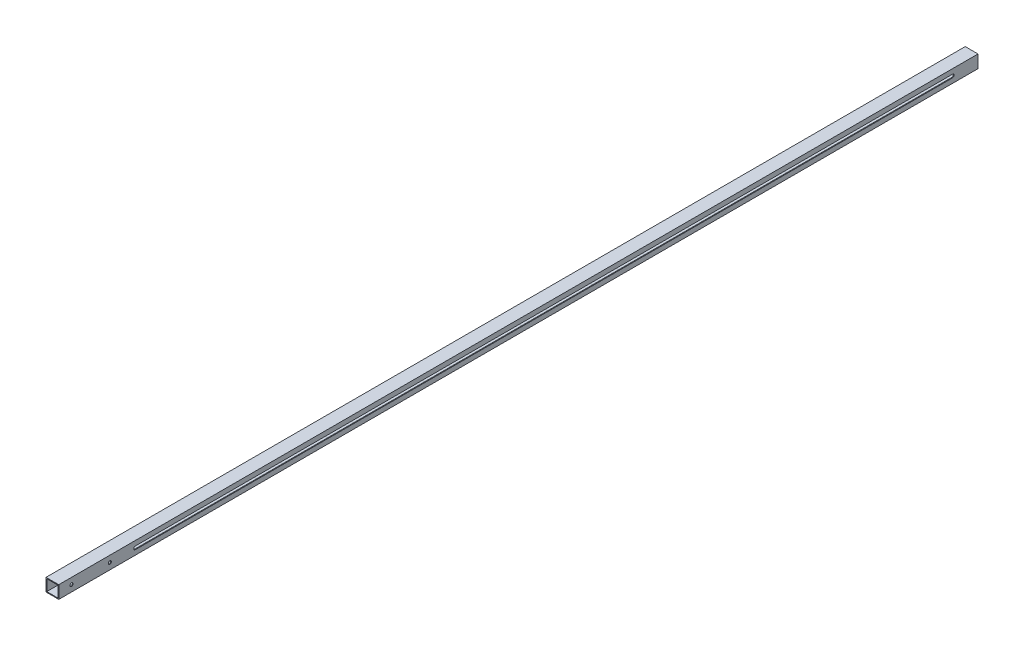
ISO-10303-21;
HEADER;
FILE_DESCRIPTION(('STEP AP214'),'2;1');
FILE_NAME('part.step','',(''),(''),'','','');
FILE_SCHEMA(('AUTOMOTIVE_DESIGN { 1 0 10303 214 1 1 1 1 }'));
ENDSEC;
DATA;
#1=APPLICATION_CONTEXT('core data for automotive mechanical design processes');
#2=APPLICATION_PROTOCOL_DEFINITION('international standard','automotive_design',2000,#1);
#3=PRODUCT_CONTEXT('',#1,'mechanical');
#4=PRODUCT('Part','Part','',(#3));
#5=PRODUCT_RELATED_PRODUCT_CATEGORY('part','',(#4));
#6=PRODUCT_DEFINITION_FORMATION('','',#4);
#7=PRODUCT_DEFINITION_CONTEXT('part definition',#1,'design');
#8=PRODUCT_DEFINITION('design','',#6,#7);
#9=PRODUCT_DEFINITION_SHAPE('','',#8);
#10=(LENGTH_UNIT() NAMED_UNIT(*) SI_UNIT(.MILLI.,.METRE.));
#11=(NAMED_UNIT(*) PLANE_ANGLE_UNIT() SI_UNIT($,.RADIAN.));
#12=(NAMED_UNIT(*) SI_UNIT($,.STERADIAN.) SOLID_ANGLE_UNIT());
#13=UNCERTAINTY_MEASURE_WITH_UNIT(LENGTH_MEASURE(1.E-05),#10,'distance_accuracy_value','');
#14=(GEOMETRIC_REPRESENTATION_CONTEXT(3) GLOBAL_UNCERTAINTY_ASSIGNED_CONTEXT((#13)) GLOBAL_UNIT_ASSIGNED_CONTEXT((#10,
#11,#12)) REPRESENTATION_CONTEXT('',''));
#15=CARTESIAN_POINT('',(0.,0.,0.));
#16=DIRECTION('',(0.,0.,1.));
#17=DIRECTION('',(1.,0.,0.));
#18=AXIS2_PLACEMENT_3D('',#15,#16,#17);
#19=CARTESIAN_POINT('',(0.,0.,1828.8));
#20=DIRECTION('',(0.,0.,1.));
#21=DIRECTION('',(1.,0.,0.));
#22=AXIS2_PLACEMENT_3D('',#19,#20,#21);
#23=PLANE('',#22);
#24=DIRECTION('',(0.,1.,0.));
#25=VECTOR('',#24,1.);
#26=CARTESIAN_POINT('',(12.7,12.7,1828.8));
#27=LINE('',#26,#25);
#28=CARTESIAN_POINT('',(12.7,-12.7,1828.8));
#29=VERTEX_POINT('',#28);
#30=CARTESIAN_POINT('',(12.7,12.7,1828.8));
#31=VERTEX_POINT('',#30);
#32=EDGE_CURVE('E253',#29,#31,#27,.T.);
#33=ORIENTED_EDGE('',*,*,#32,.T.);
#34=DIRECTION('',(-1.,0.,0.));
#35=VECTOR('',#34,1.);
#36=CARTESIAN_POINT('',(-12.7,12.7,1828.8));
#37=LINE('',#36,#35);
#38=CARTESIAN_POINT('',(-12.7,12.7,1828.8));
#39=VERTEX_POINT('',#38);
#40=EDGE_CURVE('E256',#31,#39,#37,.T.);
#41=ORIENTED_EDGE('',*,*,#40,.T.);
#42=DIRECTION('',(0.,-1.,0.));
#43=VECTOR('',#42,1.);
#44=CARTESIAN_POINT('',(-12.7,12.7,1828.8));
#45=LINE('',#44,#43);
#46=CARTESIAN_POINT('',(-12.7,-12.7,1828.8));
#47=VERTEX_POINT('',#46);
#48=EDGE_CURVE('E259',#39,#47,#45,.T.);
#49=ORIENTED_EDGE('',*,*,#48,.T.);
#50=DIRECTION('',(1.,0.,0.));
#51=VECTOR('',#50,1.);
#52=CARTESIAN_POINT('',(-12.7,-12.7,1828.8));
#53=LINE('',#52,#51);
#54=EDGE_CURVE('E261',#47,#29,#53,.T.);
#55=ORIENTED_EDGE('',*,*,#54,.T.);
#56=EDGE_LOOP('',(#33,#41,#49,#55));
#57=FACE_BOUND('',#56,.T.);
#58=DIRECTION('',(-1.,0.,0.));
#59=VECTOR('',#58,1.);
#60=CARTESIAN_POINT('',(-11.1125,11.1125,1828.8));
#61=LINE('',#60,#59);
#62=CARTESIAN_POINT('',(11.1125,11.1125,1828.8));
#63=VERTEX_POINT('',#62);
#64=CARTESIAN_POINT('',(-11.1125,11.1125,1828.8));
#65=VERTEX_POINT('',#64);
#66=EDGE_CURVE('E224',#63,#65,#61,.T.);
#67=ORIENTED_EDGE('',*,*,#66,.F.);
#68=DIRECTION('',(0.,1.,0.));
#69=VECTOR('',#68,1.);
#70=CARTESIAN_POINT('',(11.1125,11.1125,1828.8));
#71=LINE('',#70,#69);
#72=CARTESIAN_POINT('',(11.1125,-11.1125,1828.8));
#73=VERTEX_POINT('',#72);
#74=EDGE_CURVE('E222',#73,#63,#71,.T.);
#75=ORIENTED_EDGE('',*,*,#74,.F.);
#76=DIRECTION('',(1.,0.,0.));
#77=VECTOR('',#76,1.);
#78=CARTESIAN_POINT('',(-11.1125,-11.1125,1828.8));
#79=LINE('',#78,#77);
#80=CARTESIAN_POINT('',(-11.1125,-11.1125,1828.8));
#81=VERTEX_POINT('',#80);
#82=EDGE_CURVE('E230',#81,#73,#79,.T.);
#83=ORIENTED_EDGE('',*,*,#82,.F.);
#84=DIRECTION('',(0.,-1.,0.));
#85=VECTOR('',#84,1.);
#86=CARTESIAN_POINT('',(-11.1125,11.1125,1828.8));
#87=LINE('',#86,#85);
#88=EDGE_CURVE('E227',#65,#81,#87,.T.);
#89=ORIENTED_EDGE('',*,*,#88,.F.);
#90=EDGE_LOOP('',(#67,#75,#83,#89));
#91=FACE_BOUND('',#90,.T.);
#92=ADVANCED_FACE('F33',(#57,#91),#23,.T.);
#93=CARTESIAN_POINT('',(0.,0.,0.));
#94=DIRECTION('',(0.,0.,1.));
#95=DIRECTION('',(1.,0.,0.));
#96=AXIS2_PLACEMENT_3D('',#93,#94,#95);
#97=PLANE('',#96);
#98=DIRECTION('',(0.,1.,0.));
#99=VECTOR('',#98,1.);
#100=CARTESIAN_POINT('',(12.7,12.7,0.));
#101=LINE('',#100,#99);
#102=CARTESIAN_POINT('',(12.7,-12.7,0.));
#103=VERTEX_POINT('',#102);
#104=CARTESIAN_POINT('',(12.7,12.7,0.));
#105=VERTEX_POINT('',#104);
#106=EDGE_CURVE('E252',#103,#105,#101,.T.);
#107=ORIENTED_EDGE('',*,*,#106,.F.);
#108=DIRECTION('',(1.,0.,0.));
#109=VECTOR('',#108,1.);
#110=CARTESIAN_POINT('',(-12.7,-12.7,0.));
#111=LINE('',#110,#109);
#112=CARTESIAN_POINT('',(-12.7,-12.7,0.));
#113=VERTEX_POINT('',#112);
#114=EDGE_CURVE('E257',#113,#103,#111,.T.);
#115=ORIENTED_EDGE('',*,*,#114,.F.);
#116=DIRECTION('',(0.,-1.,0.));
#117=VECTOR('',#116,1.);
#118=CARTESIAN_POINT('',(-12.7,12.7,0.));
#119=LINE('',#118,#117);
#120=CARTESIAN_POINT('',(-12.7,12.7,0.));
#121=VERTEX_POINT('',#120);
#122=EDGE_CURVE('E268',#121,#113,#119,.T.);
#123=ORIENTED_EDGE('',*,*,#122,.F.);
#124=DIRECTION('',(-1.,0.,0.));
#125=VECTOR('',#124,1.);
#126=CARTESIAN_POINT('',(-12.7,12.7,0.));
#127=LINE('',#126,#125);
#128=EDGE_CURVE('E266',#105,#121,#127,.T.);
#129=ORIENTED_EDGE('',*,*,#128,.F.);
#130=EDGE_LOOP('',(#107,#115,#123,#129));
#131=FACE_BOUND('',#130,.T.);
#132=DIRECTION('',(0.,1.,0.));
#133=VECTOR('',#132,1.);
#134=CARTESIAN_POINT('',(11.1125,11.1125,0.));
#135=LINE('',#134,#133);
#136=CARTESIAN_POINT('',(11.1125,-11.1125,0.));
#137=VERTEX_POINT('',#136);
#138=CARTESIAN_POINT('',(11.1125,11.1125,0.));
#139=VERTEX_POINT('',#138);
#140=EDGE_CURVE('E221',#137,#139,#135,.T.);
#141=ORIENTED_EDGE('',*,*,#140,.T.);
#142=DIRECTION('',(-1.,0.,0.));
#143=VECTOR('',#142,1.);
#144=CARTESIAN_POINT('',(-11.1125,11.1125,0.));
#145=LINE('',#144,#143);
#146=CARTESIAN_POINT('',(-11.1125,11.1125,0.));
#147=VERTEX_POINT('',#146);
#148=EDGE_CURVE('E235',#139,#147,#145,.T.);
#149=ORIENTED_EDGE('',*,*,#148,.T.);
#150=DIRECTION('',(0.,-1.,0.));
#151=VECTOR('',#150,1.);
#152=CARTESIAN_POINT('',(-11.1125,11.1125,0.));
#153=LINE('',#152,#151);
#154=CARTESIAN_POINT('',(-11.1125,-11.1125,0.));
#155=VERTEX_POINT('',#154);
#156=EDGE_CURVE('E238',#147,#155,#153,.T.);
#157=ORIENTED_EDGE('',*,*,#156,.T.);
#158=DIRECTION('',(1.,0.,0.));
#159=VECTOR('',#158,1.);
#160=CARTESIAN_POINT('',(-11.1125,-11.1125,0.));
#161=LINE('',#160,#159);
#162=EDGE_CURVE('E225',#155,#137,#161,.T.);
#163=ORIENTED_EDGE('',*,*,#162,.T.);
#164=EDGE_LOOP('',(#141,#149,#157,#163));
#165=FACE_BOUND('',#164,.T.);
#166=ADVANCED_FACE('F312',(#131,#165),#97,.F.);
#167=CARTESIAN_POINT('',(12.7,12.7,1828.8));
#168=DIRECTION('',(-1.,0.,0.));
#169=DIRECTION('',(0.,-1.,0.));
#170=AXIS2_PLACEMENT_3D('',#167,#168,#169);
#171=PLANE('',#170);
#172=DIRECTION('',(0.,0.,-1.));
#173=VECTOR('',#172,1.);
#174=CARTESIAN_POINT('',(12.7,-3.175,1676.4));
#175=LINE('',#174,#173);
#176=CARTESIAN_POINT('',(12.7,-3.175,1676.4));
#177=VERTEX_POINT('',#176);
#178=CARTESIAN_POINT('',(12.7,-3.175,50.8));
#179=VERTEX_POINT('',#178);
#180=EDGE_CURVE('E179',#177,#179,#175,.T.);
#181=ORIENTED_EDGE('',*,*,#180,.F.);
#182=CARTESIAN_POINT('',(12.7,0.,1676.4));
#183=DIRECTION('',(1.,0.,0.));
#184=DIRECTION('',(0.,1.,0.));
#185=AXIS2_PLACEMENT_3D('',#182,#183,#184);
#186=CIRCLE('',#185,3.175);
#187=CARTESIAN_POINT('',(12.7,3.175,1676.4));
#188=VERTEX_POINT('',#187);
#189=EDGE_CURVE('E48',#188,#177,#186,.T.);
#190=ORIENTED_EDGE('',*,*,#189,.F.);
#191=DIRECTION('',(0.,0.,1.));
#192=VECTOR('',#191,1.);
#193=CARTESIAN_POINT('',(12.7,3.175,1676.4));
#194=LINE('',#193,#192);
#195=CARTESIAN_POINT('',(12.7,3.175,50.8));
#196=VERTEX_POINT('',#195);
#197=EDGE_CURVE('E170',#196,#188,#194,.T.);
#198=ORIENTED_EDGE('',*,*,#197,.F.);
#199=CARTESIAN_POINT('',(12.7,0.,50.8));
#200=DIRECTION('',(1.,0.,0.));
#201=DIRECTION('',(0.,1.,0.));
#202=AXIS2_PLACEMENT_3D('',#199,#200,#201);
#203=CIRCLE('',#202,3.175);
#204=EDGE_CURVE('E173',#179,#196,#203,.T.);
#205=ORIENTED_EDGE('',*,*,#204,.F.);
#206=EDGE_LOOP('',(#181,#190,#198,#205));
#207=FACE_BOUND('',#206,.T.);
#208=CARTESIAN_POINT('',(12.7,0.,1803.4));
#209=DIRECTION('',(1.,0.,0.));
#210=DIRECTION('',(0.,1.,0.));
#211=AXIS2_PLACEMENT_3D('',#208,#209,#210);
#212=CIRCLE('',#211,3.17499999999986);
#213=CARTESIAN_POINT('',(12.7,3.17499999999986,1803.4));
#214=VERTEX_POINT('',#213);
#215=EDGE_CURVE('E201',#214,#214,#212,.T.);
#216=ORIENTED_EDGE('',*,*,#215,.F.);
#217=EDGE_LOOP('',(#216));
#218=FACE_BOUND('',#217,.T.);
#219=CARTESIAN_POINT('',(12.7,0.,1727.2));
#220=DIRECTION('',(1.,0.,0.));
#221=DIRECTION('',(0.,1.,0.));
#222=AXIS2_PLACEMENT_3D('',#219,#220,#221);
#223=CIRCLE('',#222,3.17499999999986);
#224=CARTESIAN_POINT('',(12.7,3.17499999999986,1727.2));
#225=VERTEX_POINT('',#224);
#226=EDGE_CURVE('E211',#225,#225,#223,.T.);
#227=ORIENTED_EDGE('',*,*,#226,.F.);
#228=EDGE_LOOP('',(#227));
#229=FACE_BOUND('',#228,.T.);
#230=ORIENTED_EDGE('',*,*,#106,.T.);
#231=DIRECTION('',(0.,0.,-1.));
#232=VECTOR('',#231,1.);
#233=CARTESIAN_POINT('',(12.7,12.7,1828.8));
#234=LINE('',#233,#232);
#235=EDGE_CURVE('E279',#31,#105,#234,.T.);
#236=ORIENTED_EDGE('',*,*,#235,.F.);
#237=ORIENTED_EDGE('',*,*,#32,.F.);
#238=DIRECTION('',(0.,0.,-1.));
#239=VECTOR('',#238,1.);
#240=CARTESIAN_POINT('',(12.7,-12.7,1828.8));
#241=LINE('',#240,#239);
#242=EDGE_CURVE('E263',#29,#103,#241,.T.);
#243=ORIENTED_EDGE('',*,*,#242,.T.);
#244=EDGE_LOOP('',(#230,#236,#237,#243));
#245=FACE_BOUND('',#244,.T.);
#246=ADVANCED_FACE('F35',(#207,#218,#229,#245),#171,.F.);
#247=CARTESIAN_POINT('',(-12.7,12.7,1828.8));
#248=DIRECTION('',(0.,-1.,0.));
#249=DIRECTION('',(0.,0.,-1.));
#250=AXIS2_PLACEMENT_3D('',#247,#248,#249);
#251=PLANE('',#250);
#252=ORIENTED_EDGE('',*,*,#128,.T.);
#253=DIRECTION('',(0.,0.,-1.));
#254=VECTOR('',#253,1.);
#255=CARTESIAN_POINT('',(-12.7,12.7,1828.8));
#256=LINE('',#255,#254);
#257=EDGE_CURVE('E276',#39,#121,#256,.T.);
#258=ORIENTED_EDGE('',*,*,#257,.F.);
#259=ORIENTED_EDGE('',*,*,#40,.F.);
#260=ORIENTED_EDGE('',*,*,#235,.T.);
#261=EDGE_LOOP('',(#252,#258,#259,#260));
#262=FACE_BOUND('',#261,.T.);
#263=ADVANCED_FACE('F330',(#262),#251,.F.);
#264=CARTESIAN_POINT('',(-12.7,12.7,1828.8));
#265=DIRECTION('',(1.,0.,0.));
#266=DIRECTION('',(0.,1.,0.));
#267=AXIS2_PLACEMENT_3D('',#264,#265,#266);
#268=PLANE('',#267);
#269=DIRECTION('',(0.,0.,1.));
#270=VECTOR('',#269,1.);
#271=CARTESIAN_POINT('',(-12.7,3.175,1676.4));
#272=LINE('',#271,#270);
#273=CARTESIAN_POINT('',(-12.7,3.175,50.8));
#274=VERTEX_POINT('',#273);
#275=CARTESIAN_POINT('',(-12.7,3.175,1676.4));
#276=VERTEX_POINT('',#275);
#277=EDGE_CURVE('E169',#274,#276,#272,.T.);
#278=ORIENTED_EDGE('',*,*,#277,.T.);
#279=CARTESIAN_POINT('',(-12.7,0.,1676.4));
#280=DIRECTION('',(1.,0.,0.));
#281=DIRECTION('',(0.,1.,0.));
#282=AXIS2_PLACEMENT_3D('',#279,#280,#281);
#283=CIRCLE('',#282,3.175);
#284=CARTESIAN_POINT('',(-12.7,-3.175,1676.4));
#285=VERTEX_POINT('',#284);
#286=EDGE_CURVE('E152',#276,#285,#283,.T.);
#287=ORIENTED_EDGE('',*,*,#286,.T.);
#288=DIRECTION('',(0.,0.,-1.));
#289=VECTOR('',#288,1.);
#290=CARTESIAN_POINT('',(-12.7,-3.175,1676.4));
#291=LINE('',#290,#289);
#292=CARTESIAN_POINT('',(-12.7,-3.175,50.8));
#293=VERTEX_POINT('',#292);
#294=EDGE_CURVE('E161',#285,#293,#291,.T.);
#295=ORIENTED_EDGE('',*,*,#294,.T.);
#296=CARTESIAN_POINT('',(-12.7,0.,50.8));
#297=DIRECTION('',(1.,0.,0.));
#298=DIRECTION('',(0.,1.,0.));
#299=AXIS2_PLACEMENT_3D('',#296,#297,#298);
#300=CIRCLE('',#299,3.175);
#301=EDGE_CURVE('E56',#293,#274,#300,.T.);
#302=ORIENTED_EDGE('',*,*,#301,.T.);
#303=EDGE_LOOP('',(#278,#287,#295,#302));
#304=FACE_BOUND('',#303,.T.);
#305=CARTESIAN_POINT('',(-12.7,0.,1803.4));
#306=DIRECTION('',(1.,0.,0.));
#307=DIRECTION('',(0.,1.,0.));
#308=AXIS2_PLACEMENT_3D('',#305,#306,#307);
#309=CIRCLE('',#308,3.17499999999986);
#310=CARTESIAN_POINT('',(-12.7,3.17499999999986,1803.4));
#311=VERTEX_POINT('',#310);
#312=EDGE_CURVE('E202',#311,#311,#309,.T.);
#313=ORIENTED_EDGE('',*,*,#312,.T.);
#314=EDGE_LOOP('',(#313));
#315=FACE_BOUND('',#314,.T.);
#316=CARTESIAN_POINT('',(-12.7,0.,1727.2));
#317=DIRECTION('',(1.,0.,0.));
#318=DIRECTION('',(0.,1.,0.));
#319=AXIS2_PLACEMENT_3D('',#316,#317,#318);
#320=CIRCLE('',#319,3.17499999999986);
#321=CARTESIAN_POINT('',(-12.7,3.17499999999986,1727.2));
#322=VERTEX_POINT('',#321);
#323=EDGE_CURVE('E212',#322,#322,#320,.T.);
#324=ORIENTED_EDGE('',*,*,#323,.T.);
#325=EDGE_LOOP('',(#324));
#326=FACE_BOUND('',#325,.T.);
#327=ORIENTED_EDGE('',*,*,#122,.T.);
#328=DIRECTION('',(0.,0.,-1.));
#329=VECTOR('',#328,1.);
#330=CARTESIAN_POINT('',(-12.7,-12.7,1828.8));
#331=LINE('',#330,#329);
#332=EDGE_CURVE('E273',#47,#113,#331,.T.);
#333=ORIENTED_EDGE('',*,*,#332,.F.);
#334=ORIENTED_EDGE('',*,*,#48,.F.);
#335=ORIENTED_EDGE('',*,*,#257,.T.);
#336=EDGE_LOOP('',(#327,#333,#334,#335));
#337=FACE_BOUND('',#336,.T.);
#338=ADVANCED_FACE('F166',(#304,#315,#326,#337),#268,.F.);
#339=CARTESIAN_POINT('',(-12.7,-12.7,1828.8));
#340=DIRECTION('',(0.,1.,0.));
#341=DIRECTION('',(0.,0.,1.));
#342=AXIS2_PLACEMENT_3D('',#339,#340,#341);
#343=PLANE('',#342);
#344=ORIENTED_EDGE('',*,*,#114,.T.);
#345=ORIENTED_EDGE('',*,*,#242,.F.);
#346=ORIENTED_EDGE('',*,*,#54,.F.);
#347=ORIENTED_EDGE('',*,*,#332,.T.);
#348=EDGE_LOOP('',(#344,#345,#346,#347));
#349=FACE_BOUND('',#348,.T.);
#350=ADVANCED_FACE('F325',(#349),#343,.F.);
#351=CARTESIAN_POINT('',(11.1125,11.1125,1828.8));
#352=DIRECTION('',(-1.,0.,0.));
#353=DIRECTION('',(0.,0.,1.));
#354=AXIS2_PLACEMENT_3D('',#351,#352,#353);
#355=PLANE('',#354);
#356=CARTESIAN_POINT('',(11.1125,0.,1676.4));
#357=DIRECTION('',(-1.,0.,0.));
#358=DIRECTION('',(0.,0.,1.));
#359=AXIS2_PLACEMENT_3D('',#356,#357,#358);
#360=CIRCLE('',#359,3.175);
#361=CARTESIAN_POINT('',(11.1125,-3.175,1676.4));
#362=VERTEX_POINT('',#361);
#363=CARTESIAN_POINT('',(11.1125,3.175,1676.4));
#364=VERTEX_POINT('',#363);
#365=EDGE_CURVE('E199',#362,#364,#360,.T.);
#366=ORIENTED_EDGE('',*,*,#365,.F.);
#367=DIRECTION('',(0.,0.,1.));
#368=VECTOR('',#367,1.);
#369=CARTESIAN_POINT('',(11.1125,-3.175,1828.8));
#370=LINE('',#369,#368);
#371=CARTESIAN_POINT('',(11.1125,-3.175,50.8));
#372=VERTEX_POINT('',#371);
#373=EDGE_CURVE('E186',#372,#362,#370,.T.);
#374=ORIENTED_EDGE('',*,*,#373,.F.);
#375=CARTESIAN_POINT('',(11.1125,0.,50.8));
#376=DIRECTION('',(-1.,0.,0.));
#377=DIRECTION('',(0.,0.,1.));
#378=AXIS2_PLACEMENT_3D('',#375,#376,#377);
#379=CIRCLE('',#378,3.175);
#380=CARTESIAN_POINT('',(11.1125,3.175,50.8));
#381=VERTEX_POINT('',#380);
#382=EDGE_CURVE('E194',#381,#372,#379,.T.);
#383=ORIENTED_EDGE('',*,*,#382,.F.);
#384=DIRECTION('',(0.,0.,-1.));
#385=VECTOR('',#384,1.);
#386=CARTESIAN_POINT('',(11.1125,3.175,1828.8));
#387=LINE('',#386,#385);
#388=EDGE_CURVE('E197',#364,#381,#387,.T.);
#389=ORIENTED_EDGE('',*,*,#388,.F.);
#390=EDGE_LOOP('',(#366,#374,#383,#389));
#391=FACE_BOUND('',#390,.T.);
#392=CARTESIAN_POINT('',(11.1125,0.,1803.4));
#393=DIRECTION('',(-1.,0.,0.));
#394=DIRECTION('',(0.,0.,1.));
#395=AXIS2_PLACEMENT_3D('',#392,#393,#394);
#396=CIRCLE('',#395,3.17499999999986);
#397=CARTESIAN_POINT('',(11.1125,0.,1806.575));
#398=VERTEX_POINT('',#397);
#399=EDGE_CURVE('E208',#398,#398,#396,.T.);
#400=ORIENTED_EDGE('',*,*,#399,.F.);
#401=EDGE_LOOP('',(#400));
#402=FACE_BOUND('',#401,.T.);
#403=CARTESIAN_POINT('',(11.1125,0.,1727.2));
#404=DIRECTION('',(-1.,0.,0.));
#405=DIRECTION('',(0.,0.,1.));
#406=AXIS2_PLACEMENT_3D('',#403,#404,#405);
#407=CIRCLE('',#406,3.17499999999986);
#408=CARTESIAN_POINT('',(11.1125,0.,1730.375));
#409=VERTEX_POINT('',#408);
#410=EDGE_CURVE('E218',#409,#409,#407,.T.);
#411=ORIENTED_EDGE('',*,*,#410,.F.);
#412=EDGE_LOOP('',(#411));
#413=FACE_BOUND('',#412,.T.);
#414=ORIENTED_EDGE('',*,*,#140,.F.);
#415=DIRECTION('',(0.,0.,-1.));
#416=VECTOR('',#415,1.);
#417=CARTESIAN_POINT('',(11.1125,-11.1125,1828.8));
#418=LINE('',#417,#416);
#419=EDGE_CURVE('E232',#73,#137,#418,.T.);
#420=ORIENTED_EDGE('',*,*,#419,.F.);
#421=ORIENTED_EDGE('',*,*,#74,.T.);
#422=DIRECTION('',(0.,0.,-1.));
#423=VECTOR('',#422,1.);
#424=CARTESIAN_POINT('',(11.1125,11.1125,1828.8));
#425=LINE('',#424,#423);
#426=EDGE_CURVE('E249',#63,#139,#425,.T.);
#427=ORIENTED_EDGE('',*,*,#426,.T.);
#428=EDGE_LOOP('',(#414,#420,#421,#427));
#429=FACE_BOUND('',#428,.T.);
#430=ADVANCED_FACE('F322',(#391,#402,#413,#429),#355,.T.);
#431=CARTESIAN_POINT('',(-11.1125,11.1125,1828.8));
#432=DIRECTION('',(0.,-1.,0.));
#433=DIRECTION('',(0.,0.,-1.));
#434=AXIS2_PLACEMENT_3D('',#431,#432,#433);
#435=PLANE('',#434);
#436=ORIENTED_EDGE('',*,*,#148,.F.);
#437=ORIENTED_EDGE('',*,*,#426,.F.);
#438=ORIENTED_EDGE('',*,*,#66,.T.);
#439=DIRECTION('',(0.,0.,-1.));
#440=VECTOR('',#439,1.);
#441=CARTESIAN_POINT('',(-11.1125,11.1125,1828.8));
#442=LINE('',#441,#440);
#443=EDGE_CURVE('E247',#65,#147,#442,.T.);
#444=ORIENTED_EDGE('',*,*,#443,.T.);
#445=EDGE_LOOP('',(#436,#437,#438,#444));
#446=FACE_BOUND('',#445,.T.);
#447=ADVANCED_FACE('F363',(#446),#435,.T.);
#448=CARTESIAN_POINT('',(-11.1125,11.1125,1828.8));
#449=DIRECTION('',(1.,0.,0.));
#450=DIRECTION('',(0.,0.,-1.));
#451=AXIS2_PLACEMENT_3D('',#448,#449,#450);
#452=PLANE('',#451);
#453=CARTESIAN_POINT('',(-11.1125,0.,1676.4));
#454=DIRECTION('',(1.,0.,0.));
#455=DIRECTION('',(0.,0.,-1.));
#456=AXIS2_PLACEMENT_3D('',#453,#454,#455);
#457=CIRCLE('',#456,3.175);
#458=CARTESIAN_POINT('',(-11.1125,3.175,1676.4));
#459=VERTEX_POINT('',#458);
#460=CARTESIAN_POINT('',(-11.1125,-3.175,1676.4));
#461=VERTEX_POINT('',#460);
#462=EDGE_CURVE('E11',#459,#461,#457,.T.);
#463=ORIENTED_EDGE('',*,*,#462,.F.);
#464=DIRECTION('',(0.,0.,1.));
#465=VECTOR('',#464,1.);
#466=CARTESIAN_POINT('',(-11.1125,3.175,1828.8));
#467=LINE('',#466,#465);
#468=CARTESIAN_POINT('',(-11.1125,3.175,50.8));
#469=VERTEX_POINT('',#468);
#470=EDGE_CURVE('E41',#469,#459,#467,.T.);
#471=ORIENTED_EDGE('',*,*,#470,.F.);
#472=CARTESIAN_POINT('',(-11.1125,0.,50.8));
#473=DIRECTION('',(1.,0.,0.));
#474=DIRECTION('',(0.,0.,-1.));
#475=AXIS2_PLACEMENT_3D('',#472,#473,#474);
#476=CIRCLE('',#475,3.175);
#477=CARTESIAN_POINT('',(-11.1125,-3.175,50.8));
#478=VERTEX_POINT('',#477);
#479=EDGE_CURVE('E288',#478,#469,#476,.T.);
#480=ORIENTED_EDGE('',*,*,#479,.F.);
#481=DIRECTION('',(0.,0.,-1.));
#482=VECTOR('',#481,1.);
#483=CARTESIAN_POINT('',(-11.1125,-3.175,1828.8));
#484=LINE('',#483,#482);
#485=EDGE_CURVE('E282',#461,#478,#484,.T.);
#486=ORIENTED_EDGE('',*,*,#485,.F.);
#487=EDGE_LOOP('',(#463,#471,#480,#486));
#488=FACE_BOUND('',#487,.T.);
#489=CARTESIAN_POINT('',(-11.1125,0.,1803.4));
#490=DIRECTION('',(1.,0.,0.));
#491=DIRECTION('',(0.,0.,-1.));
#492=AXIS2_PLACEMENT_3D('',#489,#490,#491);
#493=CIRCLE('',#492,3.17499999999986);
#494=CARTESIAN_POINT('',(-11.1125,0.,1800.225));
#495=VERTEX_POINT('',#494);
#496=EDGE_CURVE('E205',#495,#495,#493,.T.);
#497=ORIENTED_EDGE('',*,*,#496,.F.);
#498=EDGE_LOOP('',(#497));
#499=FACE_BOUND('',#498,.T.);
#500=CARTESIAN_POINT('',(-11.1125,0.,1727.2));
#501=DIRECTION('',(1.,0.,0.));
#502=DIRECTION('',(0.,0.,-1.));
#503=AXIS2_PLACEMENT_3D('',#500,#501,#502);
#504=CIRCLE('',#503,3.17499999999986);
#505=CARTESIAN_POINT('',(-11.1125,0.,1724.025));
#506=VERTEX_POINT('',#505);
#507=EDGE_CURVE('E215',#506,#506,#504,.T.);
#508=ORIENTED_EDGE('',*,*,#507,.F.);
#509=EDGE_LOOP('',(#508));
#510=FACE_BOUND('',#509,.T.);
#511=ORIENTED_EDGE('',*,*,#156,.F.);
#512=ORIENTED_EDGE('',*,*,#443,.F.);
#513=ORIENTED_EDGE('',*,*,#88,.T.);
#514=DIRECTION('',(0.,0.,-1.));
#515=VECTOR('',#514,1.);
#516=CARTESIAN_POINT('',(-11.1125,-11.1125,1828.8));
#517=LINE('',#516,#515);
#518=EDGE_CURVE('E245',#81,#155,#517,.T.);
#519=ORIENTED_EDGE('',*,*,#518,.T.);
#520=EDGE_LOOP('',(#511,#512,#513,#519));
#521=FACE_BOUND('',#520,.T.);
#522=ADVANCED_FACE('F294',(#488,#499,#510,#521),#452,.T.);
#523=CARTESIAN_POINT('',(-11.1125,-11.1125,1828.8));
#524=DIRECTION('',(0.,1.,0.));
#525=DIRECTION('',(0.,0.,1.));
#526=AXIS2_PLACEMENT_3D('',#523,#524,#525);
#527=PLANE('',#526);
#528=ORIENTED_EDGE('',*,*,#162,.F.);
#529=ORIENTED_EDGE('',*,*,#518,.F.);
#530=ORIENTED_EDGE('',*,*,#82,.T.);
#531=ORIENTED_EDGE('',*,*,#419,.T.);
#532=EDGE_LOOP('',(#528,#529,#530,#531));
#533=FACE_BOUND('',#532,.T.);
#534=ADVANCED_FACE('F358',(#533),#527,.T.);
#535=CARTESIAN_POINT('',(-12.7,0.,1727.2));
#536=DIRECTION('',(1.,0.,0.));
#537=DIRECTION('',(0.,1.,0.));
#538=AXIS2_PLACEMENT_3D('',#535,#536,#537);
#539=CYLINDRICAL_SURFACE('',#538,3.17499999999986);
#540=ORIENTED_EDGE('',*,*,#507,.T.);
#541=EDGE_LOOP('',(#540));
#542=FACE_BOUND('',#541,.T.);
#543=ORIENTED_EDGE('',*,*,#323,.F.);
#544=EDGE_LOOP('',(#543));
#545=FACE_BOUND('',#544,.T.);
#546=ADVANCED_FACE('F374',(#542,#545),#539,.F.);
#547=ORIENTED_EDGE('',*,*,#410,.T.);
#548=EDGE_LOOP('',(#547));
#549=FACE_BOUND('',#548,.T.);
#550=ORIENTED_EDGE('',*,*,#226,.T.);
#551=EDGE_LOOP('',(#550));
#552=FACE_BOUND('',#551,.T.);
#553=ADVANCED_FACE('F380',(#549,#552),#539,.F.);
#554=CARTESIAN_POINT('',(-12.7,0.,1803.4));
#555=DIRECTION('',(1.,0.,0.));
#556=DIRECTION('',(0.,1.,0.));
#557=AXIS2_PLACEMENT_3D('',#554,#555,#556);
#558=CYLINDRICAL_SURFACE('',#557,3.17499999999986);
#559=ORIENTED_EDGE('',*,*,#496,.T.);
#560=EDGE_LOOP('',(#559));
#561=FACE_BOUND('',#560,.T.);
#562=ORIENTED_EDGE('',*,*,#312,.F.);
#563=EDGE_LOOP('',(#562));
#564=FACE_BOUND('',#563,.T.);
#565=ADVANCED_FACE('F382',(#561,#564),#558,.F.);
#566=ORIENTED_EDGE('',*,*,#399,.T.);
#567=EDGE_LOOP('',(#566));
#568=FACE_BOUND('',#567,.T.);
#569=ORIENTED_EDGE('',*,*,#215,.T.);
#570=EDGE_LOOP('',(#569));
#571=FACE_BOUND('',#570,.T.);
#572=ADVANCED_FACE('F306',(#568,#571),#558,.F.);
#573=CARTESIAN_POINT('',(-12.7,-3.175,1676.4));
#574=DIRECTION('',(0.,-1.,0.));
#575=DIRECTION('',(1.,0.,0.));
#576=AXIS2_PLACEMENT_3D('',#573,#574,#575);
#577=PLANE('',#576);
#578=ORIENTED_EDGE('',*,*,#485,.T.);
#579=DIRECTION('',(1.,0.,0.));
#580=VECTOR('',#579,1.);
#581=CARTESIAN_POINT('',(-12.7,-3.175,50.8));
#582=LINE('',#581,#580);
#583=EDGE_CURVE('E163',#293,#478,#582,.T.);
#584=ORIENTED_EDGE('',*,*,#583,.F.);
#585=ORIENTED_EDGE('',*,*,#294,.F.);
#586=DIRECTION('',(1.,0.,0.));
#587=VECTOR('',#586,1.);
#588=CARTESIAN_POINT('',(-12.7,-3.175,1676.4));
#589=LINE('',#588,#587);
#590=EDGE_CURVE('E147',#285,#461,#589,.T.);
#591=ORIENTED_EDGE('',*,*,#590,.T.);
#592=EDGE_LOOP('',(#578,#584,#585,#591));
#593=FACE_BOUND('',#592,.T.);
#594=ADVANCED_FACE('F162',(#593),#577,.F.);
#595=CARTESIAN_POINT('',(-12.7,0.,50.8));
#596=DIRECTION('',(1.,0.,0.));
#597=DIRECTION('',(0.,1.,0.));
#598=AXIS2_PLACEMENT_3D('',#595,#596,#597);
#599=CYLINDRICAL_SURFACE('',#598,3.175);
#600=ORIENTED_EDGE('',*,*,#479,.T.);
#601=DIRECTION('',(1.,0.,0.));
#602=VECTOR('',#601,1.);
#603=CARTESIAN_POINT('',(-12.7,3.175,50.8));
#604=LINE('',#603,#602);
#605=EDGE_CURVE('E188',#274,#469,#604,.T.);
#606=ORIENTED_EDGE('',*,*,#605,.F.);
#607=ORIENTED_EDGE('',*,*,#301,.F.);
#608=ORIENTED_EDGE('',*,*,#583,.T.);
#609=EDGE_LOOP('',(#600,#606,#607,#608));
#610=FACE_BOUND('',#609,.T.);
#611=ADVANCED_FACE('F296',(#610),#599,.F.);
#612=CARTESIAN_POINT('',(-12.7,3.175,1676.4));
#613=DIRECTION('',(0.,1.,0.));
#614=DIRECTION('',(-1.,0.,0.));
#615=AXIS2_PLACEMENT_3D('',#612,#613,#614);
#616=PLANE('',#615);
#617=ORIENTED_EDGE('',*,*,#470,.T.);
#618=DIRECTION('',(1.,0.,0.));
#619=VECTOR('',#618,1.);
#620=CARTESIAN_POINT('',(-12.7,3.175,1676.4));
#621=LINE('',#620,#619);
#622=EDGE_CURVE('E184',#276,#459,#621,.T.);
#623=ORIENTED_EDGE('',*,*,#622,.F.);
#624=ORIENTED_EDGE('',*,*,#277,.F.);
#625=ORIENTED_EDGE('',*,*,#605,.T.);
#626=EDGE_LOOP('',(#617,#623,#624,#625));
#627=FACE_BOUND('',#626,.T.);
#628=ADVANCED_FACE('F291',(#627),#616,.F.);
#629=CARTESIAN_POINT('',(-12.7,0.,1676.4));
#630=DIRECTION('',(1.,0.,0.));
#631=DIRECTION('',(0.,1.,0.));
#632=AXIS2_PLACEMENT_3D('',#629,#630,#631);
#633=CYLINDRICAL_SURFACE('',#632,3.175);
#634=ORIENTED_EDGE('',*,*,#462,.T.);
#635=ORIENTED_EDGE('',*,*,#590,.F.);
#636=ORIENTED_EDGE('',*,*,#286,.F.);
#637=ORIENTED_EDGE('',*,*,#622,.T.);
#638=EDGE_LOOP('',(#634,#635,#636,#637));
#639=FACE_BOUND('',#638,.T.);
#640=ADVANCED_FACE('F149',(#639),#633,.F.);
#641=ORIENTED_EDGE('',*,*,#365,.T.);
#642=EDGE_CURVE('E187',#364,#188,#621,.T.);
#643=ORIENTED_EDGE('',*,*,#642,.T.);
#644=ORIENTED_EDGE('',*,*,#189,.T.);
#645=EDGE_CURVE('E158',#362,#177,#589,.T.);
#646=ORIENTED_EDGE('',*,*,#645,.F.);
#647=EDGE_LOOP('',(#641,#643,#644,#646));
#648=FACE_BOUND('',#647,.T.);
#649=ADVANCED_FACE('F387',(#648),#633,.F.);
#650=ORIENTED_EDGE('',*,*,#388,.T.);
#651=EDGE_CURVE('E191',#381,#196,#604,.T.);
#652=ORIENTED_EDGE('',*,*,#651,.T.);
#653=ORIENTED_EDGE('',*,*,#197,.T.);
#654=ORIENTED_EDGE('',*,*,#642,.F.);
#655=EDGE_LOOP('',(#650,#652,#653,#654));
#656=FACE_BOUND('',#655,.T.);
#657=ADVANCED_FACE('F305',(#656),#616,.F.);
#658=ORIENTED_EDGE('',*,*,#382,.T.);
#659=EDGE_CURVE('E157',#372,#179,#582,.T.);
#660=ORIENTED_EDGE('',*,*,#659,.T.);
#661=ORIENTED_EDGE('',*,*,#204,.T.);
#662=ORIENTED_EDGE('',*,*,#651,.F.);
#663=EDGE_LOOP('',(#658,#660,#661,#662));
#664=FACE_BOUND('',#663,.T.);
#665=ADVANCED_FACE('F299',(#664),#599,.F.);
#666=ORIENTED_EDGE('',*,*,#373,.T.);
#667=ORIENTED_EDGE('',*,*,#645,.T.);
#668=ORIENTED_EDGE('',*,*,#180,.T.);
#669=ORIENTED_EDGE('',*,*,#659,.F.);
#670=EDGE_LOOP('',(#666,#667,#668,#669));
#671=FACE_BOUND('',#670,.T.);
#672=ADVANCED_FACE('F308',(#671),#577,.F.);
#673=CLOSED_SHELL('',(#92,#166,#246,#263,#338,#350,#430,#447,#522,#534,#546,#553,#565,#572,#594,
#611,#628,#640,#649,#657,#665,#672));
#674=MANIFOLD_SOLID_BREP('B2',#673);
#675=ADVANCED_BREP_SHAPE_REPRESENTATION('',(#18,#674),#14);
#676=SHAPE_DEFINITION_REPRESENTATION(#9,#675);
ENDSEC;
END-ISO-10303-21;
